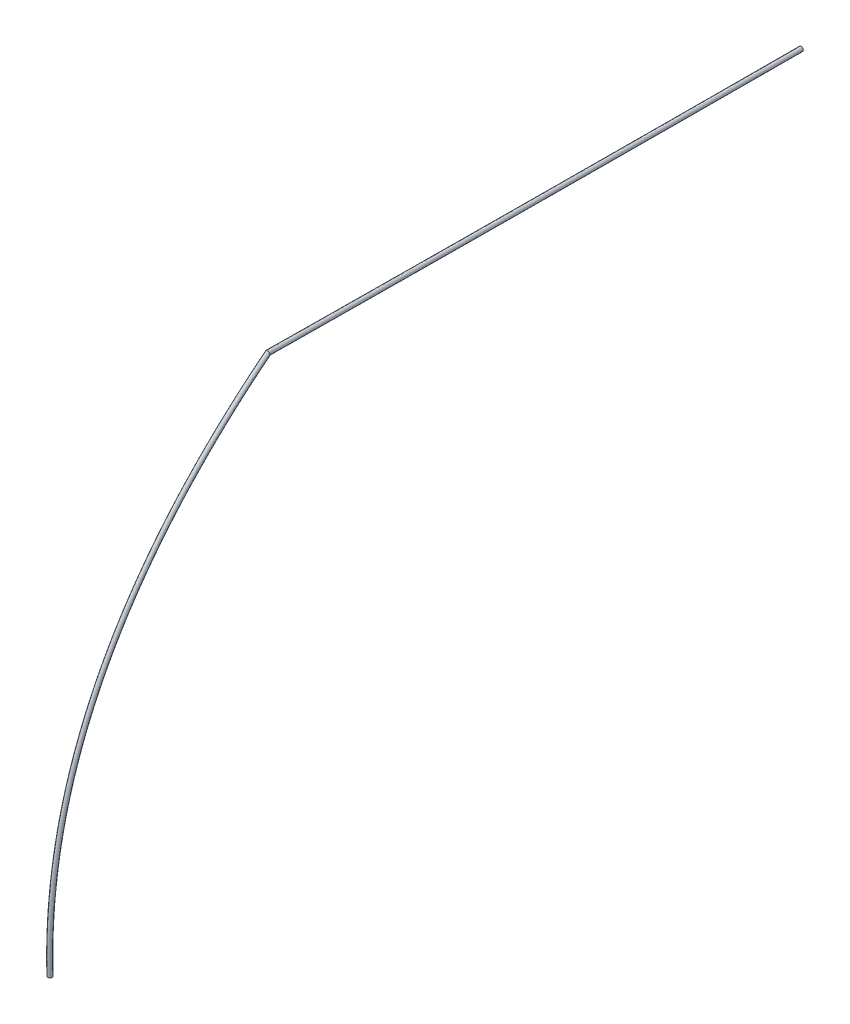
ISO-10303-21;
HEADER;
FILE_DESCRIPTION(('STEP AP214'),'2;1');
FILE_NAME('part.step','',(''),(''),'','','');
FILE_SCHEMA(('AUTOMOTIVE_DESIGN { 1 0 10303 214 1 1 1 1 }'));
ENDSEC;
DATA;
#1=APPLICATION_CONTEXT('core data for automotive mechanical design processes');
#2=APPLICATION_PROTOCOL_DEFINITION('international standard','automotive_design',2000,#1);
#3=PRODUCT_CONTEXT('',#1,'mechanical');
#4=PRODUCT('Part','Part','',(#3));
#5=PRODUCT_RELATED_PRODUCT_CATEGORY('part','',(#4));
#6=PRODUCT_DEFINITION_FORMATION('','',#4);
#7=PRODUCT_DEFINITION_CONTEXT('part definition',#1,'design');
#8=PRODUCT_DEFINITION('design','',#6,#7);
#9=PRODUCT_DEFINITION_SHAPE('','',#8);
#10=(LENGTH_UNIT() NAMED_UNIT(*) SI_UNIT(.MILLI.,.METRE.));
#11=(NAMED_UNIT(*) PLANE_ANGLE_UNIT() SI_UNIT($,.RADIAN.));
#12=(NAMED_UNIT(*) SI_UNIT($,.STERADIAN.) SOLID_ANGLE_UNIT());
#13=UNCERTAINTY_MEASURE_WITH_UNIT(LENGTH_MEASURE(1.E-05),#10,'distance_accuracy_value','');
#14=(GEOMETRIC_REPRESENTATION_CONTEXT(3) GLOBAL_UNCERTAINTY_ASSIGNED_CONTEXT((#13)) GLOBAL_UNIT_ASSIGNED_CONTEXT((#10,
#11,#12)) REPRESENTATION_CONTEXT('',''));
#15=CARTESIAN_POINT('',(0.,0.,0.));
#16=DIRECTION('',(0.,0.,1.));
#17=DIRECTION('',(1.,0.,0.));
#18=AXIS2_PLACEMENT_3D('',#15,#16,#17);
#19=CARTESIAN_POINT('',(-252.18850722934,-2246.93364927449,7208.37977316009));
#20=DIRECTION('',(0.00187095814067323,-0.999442047397408,-0.0333480645572148));
#21=DIRECTION('',(0.996001194043314,-0.00111622715859024,0.0893329474562594));
#22=AXIS2_PLACEMENT_3D('',#19,#20,#21);
#23=PLANE('',#22);
#24=CARTESIAN_POINT('',(-252.18850722934,-2246.93364927449,7208.37977316009));
#25=DIRECTION('',(0.00187095814067323,-0.999442047397408,-0.0333480645572148));
#26=DIRECTION('',(0.996001194043314,-0.00111622715859024,0.0893329474562594));
#27=AXIS2_PLACEMENT_3D('',#24,#25,#26);
#28=CIRCLE('',#27,19.05);
#29=CARTESIAN_POINT('',(-233.214684482815,-2246.95491340187,7210.08156580914));
#30=VERTEX_POINT('',#29);
#31=EDGE_CURVE('E46',#30,#30,#28,.T.);
#32=ORIENTED_EDGE('',*,*,#31,.T.);
#33=EDGE_LOOP('',(#32));
#34=FACE_BOUND('',#33,.T.);
#35=ADVANCED_FACE('F43',(#34),#23,.T.);
#36=CARTESIAN_POINT('',(20.8652226595486,1756.45567892885,927.868940997193));
#37=DIRECTION('',(0.,0.,1.));
#38=DIRECTION('',(1.,0.,0.));
#39=AXIS2_PLACEMENT_3D('',#36,#37,#38);
#40=PLANE('',#39);
#41=CARTESIAN_POINT('',(20.8652226595486,1756.45567892885,927.868940997193));
#42=DIRECTION('',(0.,0.,1.));
#43=DIRECTION('',(1.,0.,0.));
#44=AXIS2_PLACEMENT_3D('',#41,#42,#43);
#45=CIRCLE('',#44,19.05);
#46=CARTESIAN_POINT('',(39.9152226595486,1756.45567892885,927.868940997193));
#47=VERTEX_POINT('',#46);
#48=EDGE_CURVE('E65',#47,#47,#45,.T.);
#49=ORIENTED_EDGE('',*,*,#48,.F.);
#50=EDGE_LOOP('',(#49));
#51=FACE_BOUND('',#50,.T.);
#52=ADVANCED_FACE('F96',(#51),#40,.F.);
#53=CARTESIAN_POINT('',(19.9930689835937,1777.36160258511,5545.85894253114));
#54=CARTESIAN_POINT('',(19.3355368097014,1772.66039736171,5550.28089226517));
#55=CARTESIAN_POINT('',(18.6779618821094,1767.95889001023,5554.7031295848));
#56=CARTESIAN_POINT('',(17.3550982955482,1758.50070963912,5563.59947936861));
#57=CARTESIAN_POINT('',(16.6911317688225,1753.74222914693,5568.06450398315));
#58=CARTESIAN_POINT('',(15.3657547904619,1744.22102663837,5576.9769706444));
#59=CARTESIAN_POINT('',(14.7043875405338,1739.45861048081,5581.42412212676));
#60=CARTESIAN_POINT('',(12.7242495028948,1725.16591731002,5594.73833107276));
#61=CARTESIAN_POINT('',(11.4094424285931,1715.63019559349,5603.57814296001));
#62=CARTESIAN_POINT('',(7.48087602867862,1687.00125176661,5629.98859663978));
#63=CARTESIAN_POINT('',(4.88297152858878,1667.88625098898,5647.45025651571));
#64=CARTESIAN_POINT('',(-2.84732290263034,1610.45413495788,5699.39930988561));
#65=CARTESIAN_POINT('',(-7.91629375987648,1572.04990598364,5733.4507770182));
#66=CARTESIAN_POINT('',(-22.8695319936948,1456.48877165584,5833.86148683239));
#67=CARTESIAN_POINT('',(-32.5001249693716,1378.98341912199,5898.47703743689));
#68=CARTESIAN_POINT('',(-60.3772239575552,1145.07361951336,6085.34904262698));
#69=CARTESIAN_POINT('',(-77.6090492721612,987.275439330475,6200.63084577142));
#70=CARTESIAN_POINT('',(-125.245974180515,508.306083821919,6518.57882723388));
#71=CARTESIAN_POINT('',(-151.592523215257,181.560299240317,6693.34758512464));
#72=CARTESIAN_POINT('',(-193.463898099958,-486.800387815492,6968.49930287592));
#73=CARTESIAN_POINT('',(-208.988750468306,-828.415357870622,7068.88244404288));
#74=CARTESIAN_POINT('',(-229.217488003033,-1526.52359716673,7195.26794739456));
#75=CARTESIAN_POINT('',(-233.921378028054,-1883.01709422352,7221.27034041267));
#76=CARTESIAN_POINT('',(-233.214684482815,-2246.95491340187,7210.08156580914));
#77=CARTESIAN_POINT('',(18.1584876422309,1803.4986348941,5573.51938094741));
#78=CARTESIAN_POINT('',(17.5009554683385,1798.7974296707,5577.94133068145));
#79=CARTESIAN_POINT('',(16.8449050889727,1794.1068785701,5582.35331628602));
#80=CARTESIAN_POINT('',(15.5189741232593,1784.62665430759,5591.27029244064));
#81=CARTESIAN_POINT('',(14.8503781892923,1779.8348518224,5595.76644625644));
#82=CARTESIAN_POINT('',(13.5188263098361,1770.26906206078,5604.720431915));
#83=CARTESIAN_POINT('',(12.8543707351721,1765.48429300619,5609.18834785364));
#84=CARTESIAN_POINT('',(10.8649652223897,1751.12436276139,5622.56486417304));
#85=CARTESIAN_POINT('',(9.54397649707592,1741.54357848287,5631.44623300628));
#86=CARTESIAN_POINT('',(5.59685613419261,1712.77872892997,5657.98140671279));
#87=CARTESIAN_POINT('',(2.98657030580701,1693.57216691362,5675.52627890123));
#88=CARTESIAN_POINT('',(-4.78089593565253,1635.86246005635,5727.7251090913));
#89=CARTESIAN_POINT('',(-9.87468522402128,1597.26929374572,5761.94328148546));
#90=CARTESIAN_POINT('',(-24.9024200392103,1481.12945895814,5862.85418243224));
#91=CARTESIAN_POINT('',(-34.5827344442719,1403.22244191747,5927.80330785993));
#92=CARTESIAN_POINT('',(-62.6085336806022,1168.05839768658,6115.67199975976));
#93=CARTESIAN_POINT('',(-79.9389011216102,1009.3580789138,6231.61305918607));
#94=CARTESIAN_POINT('',(-127.863517684465,527.480151406309,6551.48093204932));
#95=CARTESIAN_POINT('',(-154.391258773977,198.518394171012,6727.4521632449));
#96=CARTESIAN_POINT('',(-196.565137569496,-474.705204311014,7004.59114422868));
#97=CARTESIAN_POINT('',(-212.210352300016,-818.964620023371,7105.75261479604));
#98=CARTESIAN_POINT('',(-232.593120189293,-1522.46092016144,7233.09920984275));
#99=CARTESIAN_POINT('',(-237.330509573372,-1881.68982754755,7259.28335274389));
#100=CARTESIAN_POINT('',(-236.617788976608,-2248.22676189918,7248.00795874604));
#101=CARTESIAN_POINT('',(-19.700202222522,1805.06006788384,5569.53296291326));
#102=CARTESIAN_POINT('',(-20.3577343964144,1800.35886266043,5573.95491264874));
#103=CARTESIAN_POINT('',(-21.0136993319229,1795.66891592593,5578.36632352495));
#104=CARTESIAN_POINT('',(-22.3398022100114,1786.18747568354,5587.28445602565));
#105=CARTESIAN_POINT('',(-23.0086576039116,1781.39383507232,5591.78235502627));
#106=CARTESIAN_POINT('',(-24.3405555715037,1771.82558570624,5600.73866841085));
#107=CARTESIAN_POINT('',(-25.0051842426302,1767.0395835552,5605.20774851437));
#108=CARTESIAN_POINT('',(-26.9951091951415,1752.67594411753,5618.58775818197));
#109=CARTESIAN_POINT('',(-28.3164444145411,1743.09267382931,5627.47145706338));
#110=CARTESIAN_POINT('',(-32.2646048071133,1714.32032635545,5654.01362395864));
#111=CARTESIAN_POINT('',(-34.8755847190111,1695.10871254013,5671.56316234445));
#112=CARTESIAN_POINT('',(-42.6451349435276,1637.3836887386,5723.77600021644));
#113=CARTESIAN_POINT('',(-47.7403158767096,1598.78009572763,5758.0035231454));
#114=CARTESIAN_POINT('',(-62.7722286881957,1482.60832001809,5858.9424854431));
#115=CARTESIAN_POINT('',(-72.4553326250294,1404.67912724489,5923.91033166766));
#116=CARTESIAN_POINT('',(-100.489477859943,1169.44581631448,6111.83498361922));
#117=CARTESIAN_POINT('',(-117.825380710693,1010.69565000493,6227.81308974723));
#118=CARTESIAN_POINT('',(-165.76617564052,528.656916515392,6547.78897651673));
#119=CARTESIAN_POINT('',(-192.304130990329,199.572526842321,6723.82803400319));
#120=CARTESIAN_POINT('',(-234.495138235376,-473.920481967876,7001.07964138869));
#121=CARTESIAN_POINT('',(-250.147214201317,-818.326539881205,7102.28555231956));
#122=CARTESIAN_POINT('',(-270.538892589564,-1522.12190745459,7229.68796576759));
#123=CARTESIAN_POINT('',(-275.27832140534,-1881.50278429179,7255.88342787237));
#124=CARTESIAN_POINT('',(-274.565434469658,-2248.18423364444,7244.60437344795));
#125=CARTESIAN_POINT('',(-17.8656208811592,1778.92303557484,5541.87252449698));
#126=CARTESIAN_POINT('',(-18.5231530550516,1774.22183035144,5546.29447423102));
#127=CARTESIAN_POINT('',(-19.1806425387862,1769.52092736606,5550.71613682229));
#128=CARTESIAN_POINT('',(-20.5036780377226,1760.06153101507,5559.61364295508));
#129=CARTESIAN_POINT('',(-21.1679040243813,1755.30121239686,5564.08041275298));
#130=CARTESIAN_POINT('',(-22.4936270908778,1745.77755028383,5572.99520714026));
#131=CARTESIAN_POINT('',(-23.1551674372231,1741.01390102981,5577.44352278749));
#132=CARTESIAN_POINT('',(-25.1358249147273,1726.71749866616,5590.76122508169));
#133=CARTESIAN_POINT('',(-26.4509784829334,1717.17929093849,5599.6033670113));
#134=CARTESIAN_POINT('',(-30.3805849128085,1688.54284919499,5626.02081389722));
#135=CARTESIAN_POINT('',(-32.9791834960493,1669.4227966126,5643.48713995893));
#136=CARTESIAN_POINT('',(-40.7115619108654,1611.97536364589,5695.45020101075));
#137=CARTESIAN_POINT('',(-45.7819244125648,1573.56070796555,5729.51101870092));
#138=CARTESIAN_POINT('',(-60.7393406426802,1457.9676327158,5829.94978979771));
#139=CARTESIAN_POINT('',(-70.3727231501291,1380.44010444941,5894.58406126687));
#140=CARTESIAN_POINT('',(-98.258168136896,1146.46103814125,6081.51202644192));
#141=CARTESIAN_POINT('',(-115.495528862579,988.613010421607,6196.83087646069));
#142=CARTESIAN_POINT('',(-163.148632133901,509.482848931002,6514.88687144506));
#143=CARTESIAN_POINT('',(-189.505395434121,182.614431911625,6689.72345572213));
#144=CARTESIAN_POINT('',(-231.393898763325,-486.015665472354,6964.98780019671));
#145=CARTESIAN_POINT('',(-246.925612364681,-827.777277728455,7065.41538164522));
#146=CARTESIAN_POINT('',(-267.16326040823,-1526.18458445988,7191.85670324058));
#147=CARTESIAN_POINT('',(-271.869189834752,-1882.83005084646,7217.87041521769));
#148=CARTESIAN_POINT('',(-271.162329975865,-2246.91238514712,7206.67798051105));
#149=CARTESIAN_POINT('',(-16.0310395397964,1752.78600326585,5514.21208608071));
#150=CARTESIAN_POINT('',(-16.6885717136888,1748.08479804244,5518.6340358133));
#151=CARTESIAN_POINT('',(-17.3475857456495,1743.37293880619,5523.06595011963));
#152=CARTESIAN_POINT('',(-18.6675538654338,1733.9355863466,5531.94282988451));
#153=CARTESIAN_POINT('',(-19.3271504448511,1729.20858972139,5536.37847047969));
#154=CARTESIAN_POINT('',(-20.646698610252,1719.72951486142,5545.25174586967));
#155=CARTESIAN_POINT('',(-21.305150631816,1714.98821850443,5549.67929706061));
#156=CARTESIAN_POINT('',(-23.276540634313,1700.75905321479,5562.93469198142));
#157=CARTESIAN_POINT('',(-24.5855125513257,1691.26590804767,5571.73527695923));
#158=CARTESIAN_POINT('',(-28.4965650185036,1662.76537203454,5598.02800383581));
#159=CARTESIAN_POINT('',(-31.0827822730875,1643.73688068508,5615.41111757341));
#160=CARTESIAN_POINT('',(-38.7779888782034,1586.56703855319,5667.12440180507));
#161=CARTESIAN_POINT('',(-43.8235329484201,1548.34132020348,5701.01851425645));
#162=CARTESIAN_POINT('',(-58.7064525971647,1433.32694541351,5800.95709415232));
#163=CARTESIAN_POINT('',(-68.2901136752289,1356.20108165393,5865.25779086609));
#164=CARTESIAN_POINT('',(-96.026858413849,1123.47625996802,6051.18906926462));
#165=CARTESIAN_POINT('',(-113.165677014464,966.530370838284,6165.84866317416));
#166=CARTESIAN_POINT('',(-160.531088627282,490.308781346612,6481.9847663734));
#167=CARTESIAN_POINT('',(-186.706659877914,165.656336980929,6655.61887744107));
#168=CARTESIAN_POINT('',(-228.292659291275,-498.110848976832,6928.89595900474));
#169=CARTESIAN_POINT('',(-243.704010528045,-837.228015575706,7028.54521097088));
#170=CARTESIAN_POINT('',(-263.787628226895,-1530.24726146518,7154.02544071358));
#171=CARTESIAN_POINT('',(-268.460058264163,-1884.15731740113,7179.85740256302));
#172=CARTESIAN_POINT('',(-267.759225482073,-2245.64053664981,7168.75158757415));
#173=CARTESIAN_POINT('',(21.8276503249565,1751.22457027612,5518.19850411486));
#174=CARTESIAN_POINT('',(21.1701181510641,1746.52336505271,5522.6204538489));
#175=CARTESIAN_POINT('',(20.5110186752461,1741.81090145036,5527.05294288358));
#176=CARTESIAN_POINT('',(19.1912224678369,1732.37476497065,5535.92866629659));
#177=CARTESIAN_POINT('',(18.5318853483528,1727.64960647147,5540.36256170986));
#178=CARTESIAN_POINT('',(17.2126832710878,1718.17299121596,5549.23350937382));
#179=CARTESIAN_POINT('',(16.5544043458955,1713.43292795542,5553.65989639987));
#180=CARTESIAN_POINT('',(14.5835337833999,1699.20747185865,5566.91179797249));
#181=CARTESIAN_POINT('',(13.2749083601102,1689.71681270412,5575.71005291373));
#182=CARTESIAN_POINT('',(9.36489592316458,1661.22377460326,5601.99578656677));
#183=CARTESIAN_POINT('',(6.77937275137053,1642.20033506434,5619.37423413019));
#184=CARTESIAN_POINT('',(-0.913749869608184,1585.04580985942,5671.07351067993));
#185=CARTESIAN_POINT('',(-5.95790229573169,1546.83051822156,5704.95827255095));
#186=CARTESIAN_POINT('',(-20.8366439481793,1431.84808435355,5804.86879123255));
#187=CARTESIAN_POINT('',(-30.4175154944713,1354.74439632651,5869.15076701385));
#188=CARTESIAN_POINT('',(-58.1459142345081,1122.08884134013,6055.0260854942));
#189=CARTESIAN_POINT('',(-75.2791974227122,965.192799747152,6169.64863235678));
#190=CARTESIAN_POINT('',(-122.628430676565,489.132016237528,6485.67672241844));
#191=CARTESIAN_POINT('',(-148.793787656537,164.602204309621,6659.24300700437));
#192=CARTESIAN_POINT('',(-190.36265863042,-498.89557131997,6932.40746152315));
#193=CARTESIAN_POINT('',(-205.767148636596,-837.866095717872,7032.01227328973));
#194=CARTESIAN_POINT('',(-225.841855816773,-1530.58627417203,7157.43668494637));
#195=CARTESIAN_POINT('',(-230.512246482736,-1884.34436089949,7183.25732808146));
#196=CARTESIAN_POINT('',(-229.811579989022,-2245.68306490455,7172.15517287224));
#197=CARTESIAN_POINT('',(19.9930689835937,1777.36160258511,5545.85894253114));
#198=CARTESIAN_POINT('',(19.3355368097014,1772.66039736171,5550.28089226517));
#199=CARTESIAN_POINT('',(18.6779618821094,1767.95889001023,5554.7031295848));
#200=CARTESIAN_POINT('',(17.3550982955482,1758.50070963912,5563.59947936861));
#201=CARTESIAN_POINT('',(16.6911317688225,1753.74222914693,5568.06450398315));
#202=CARTESIAN_POINT('',(15.3657547904619,1744.22102663837,5576.9769706444));
#203=CARTESIAN_POINT('',(14.7043875405338,1739.45861048081,5581.42412212676));
#204=CARTESIAN_POINT('',(12.7242495028948,1725.16591731002,5594.73833107276));
#205=CARTESIAN_POINT('',(11.4094424285931,1715.63019559349,5603.57814296001));
#206=CARTESIAN_POINT('',(7.48087602867862,1687.00125176661,5629.98859663978));
#207=CARTESIAN_POINT('',(4.88297152858878,1667.88625098898,5647.45025651571));
#208=CARTESIAN_POINT('',(-2.84732290263034,1610.45413495788,5699.39930988561));
#209=CARTESIAN_POINT('',(-7.91629375987648,1572.04990598364,5733.4507770182));
#210=CARTESIAN_POINT('',(-22.8695319936948,1456.48877165584,5833.86148683239));
#211=CARTESIAN_POINT('',(-32.5001249693716,1378.98341912199,5898.47703743689));
#212=CARTESIAN_POINT('',(-60.3772239575552,1145.07361951336,6085.34904262698));
#213=CARTESIAN_POINT('',(-77.6090492721612,987.275439330475,6200.63084577142));
#214=CARTESIAN_POINT('',(-125.245974180515,508.306083821919,6518.57882723388));
#215=CARTESIAN_POINT('',(-151.592523215257,181.560299240317,6693.34758512464));
#216=CARTESIAN_POINT('',(-193.463898099958,-486.800387815492,6968.49930287592));
#217=CARTESIAN_POINT('',(-208.988750468306,-828.415357870622,7068.88244404288));
#218=CARTESIAN_POINT('',(-229.217488003033,-1526.52359716673,7195.26794739456));
#219=CARTESIAN_POINT('',(-233.921378028054,-1883.01709422352,7221.27034041267));
#220=CARTESIAN_POINT('',(-233.214684482815,-2246.95491340187,7210.08156580914));
#221=(BOUNDED_SURFACE() B_SPLINE_SURFACE(3,3,((#53,#54,#55,#56,#57,#58,#59,#60,#61,#62,#63,#64,
#65,#66,#67,#68,#69,#70,#71,#72,#73,#74,#75,#76),(#77,#78,#79,#80,#81,#82,#83,#84,#85,#86,#87,
#88,#89,#90,#91,#92,#93,#94,#95,#96,#97,#98,#99,#100),(#101,#102,#103,#104,#105,#106,#107,#108,
#109,#110,#111,#112,#113,#114,#115,#116,#117,#118,#119,#120,#121,#122,#123,#124),(#125,#126,
#127,#128,#129,#130,#131,#132,#133,#134,#135,#136,#137,#138,#139,#140,#141,#142,#143,#144,#145,
#146,#147,#148),(#149,#150,#151,#152,#153,#154,#155,#156,#157,#158,#159,#160,#161,#162,#163,
#164,#165,#166,#167,#168,#169,#170,#171,#172),(#173,#174,#175,#176,#177,#178,#179,#180,#181,
#182,#183,#184,#185,#186,#187,#188,#189,#190,#191,#192,#193,#194,#195,#196),(#197,#198,#199,
#200,#201,#202,#203,#204,#205,#206,#207,#208,#209,#210,#211,#212,#213,#214,#215,#216,#217,#218,
#219,#220)),.UNSPECIFIED.,.T.,.F.,.F.) B_SPLINE_SURFACE_WITH_KNOTS((4,3,4),(4,2,2,2,2,2,2,2,2,2,
2,4),(0.,0.5,1.),(-0.0038599605490093,0.,0.00390625,0.0078125,0.015625,0.03125,0.0625,0.125,
0.25,0.5,0.75,1.),.UNSPECIFIED.) GEOMETRIC_REPRESENTATION_ITEM() RATIONAL_B_SPLINE_SURFACE(((1.,
1.,1.,1.,1.,1.,1.,1.,1.,1.,1.,1.,1.,1.,1.,1.,1.,1.,1.,1.,1.,1.,1.,1.),(0.333333333333333,
0.333333333333333,0.333333333333333,0.333333333333333,0.333333333333333,0.333333333333333,
0.333333333333333,0.333333333333333,0.333333333333333,0.333333333333333,0.333333333333333,
0.333333333333333,0.333333333333333,0.333333333333333,0.333333333333333,0.333333333333333,
0.333333333333333,0.333333333333333,0.333333333333333,0.333333333333333,0.333333333333333,
0.333333333333333,0.333333333333333,0.333333333333333),(0.333333333333333,0.333333333333333,
0.333333333333333,0.333333333333333,0.333333333333333,0.333333333333333,0.333333333333333,
0.333333333333333,0.333333333333333,0.333333333333333,0.333333333333333,0.333333333333333,
0.333333333333333,0.333333333333333,0.333333333333333,0.333333333333333,0.333333333333333,
0.333333333333333,0.333333333333333,0.333333333333333,0.333333333333333,0.333333333333333,
0.333333333333333,0.333333333333333),(1.,1.,1.,1.,1.,1.,1.,1.,1.,1.,1.,1.,1.,1.,1.,1.,1.,1.,1.,
1.,1.,1.,1.,1.),(0.333333333333333,0.333333333333333,0.333333333333333,0.333333333333333,
0.333333333333333,0.333333333333333,0.333333333333333,0.333333333333333,0.333333333333333,
0.333333333333333,0.333333333333333,0.333333333333333,0.333333333333333,0.333333333333333,
0.333333333333333,0.333333333333333,0.333333333333333,0.333333333333333,0.333333333333333,
0.333333333333333,0.333333333333333,0.333333333333333,0.333333333333333,0.333333333333333),
(0.333333333333333,0.333333333333333,0.333333333333333,0.333333333333333,0.333333333333333,
0.333333333333333,0.333333333333333,0.333333333333333,0.333333333333333,0.333333333333333,
0.333333333333333,0.333333333333333,0.333333333333333,0.333333333333333,0.333333333333333,
0.333333333333333,0.333333333333333,0.333333333333333,0.333333333333333,0.333333333333333,
0.333333333333333,0.333333333333333,0.333333333333333,0.333333333333333),(1.,1.,1.,1.,1.,1.,1.,
1.,1.,1.,1.,1.,1.,1.,1.,1.,1.,1.,1.,1.,1.,1.,1.,1.))) REPRESENTATION_ITEM('') SURFACE());
#222=CARTESIAN_POINT('',(17.9797070556018,1761.57094989232,5557.31666536347));
#223=CARTESIAN_POINT('',(17.9809437308594,1761.58073773358,5557.32096119298));
#224=CARTESIAN_POINT('',(17.982172807388,1761.59052665233,5557.3252569828));
#225=CARTESIAN_POINT('',(18.0542698090882,1762.16837527862,5557.57881104861));
#226=CARTESIAN_POINT('',(18.0995573157962,1762.74002202747,5557.82791855133));
#227=CARTESIAN_POINT('',(18.1384685982519,1763.88630570849,5558.32401189403));
#228=CARTESIAN_POINT('',(18.1320554176419,1764.46094448613,5558.57099608998));
#229=CARTESIAN_POINT('',(18.0671543104554,1765.61056735746,5559.06167302012));
#230=CARTESIAN_POINT('',(18.0085271523412,1766.18554826415,5559.30535518432));
#231=CARTESIAN_POINT('',(17.8389249827471,1767.33007063158,5559.78692042121));
#232=CARTESIAN_POINT('',(17.7279597223038,1767.89961308539,5560.02480456545));
#233=CARTESIAN_POINT('',(17.4536508369517,1769.02978087005,5560.49327413889));
#234=CARTESIAN_POINT('',(17.2902514777669,1769.59039604318,5560.72385151361));
#235=CARTESIAN_POINT('',(16.9114538085645,1770.69775026782,5561.17559758541));
#236=CARTESIAN_POINT('',(16.6960525018669,1771.24448851764,5561.39676573943));
#237=CARTESIAN_POINT('',(16.2141094705661,1772.31910094936,5561.82760249975));
#238=CARTESIAN_POINT('',(15.9476080541254,1772.84698961319,5562.03728000345));
#239=CARTESIAN_POINT('',(15.3644035673766,1773.87964293624,5562.44336336476));
#240=CARTESIAN_POINT('',(15.0477038508902,1774.38440913741,5562.63977010775));
#241=CARTESIAN_POINT('',(14.3816431471884,1775.34292021303,5563.00845941596));
#242=CARTESIAN_POINT('',(14.0345161978954,1775.79794802511,5563.18144189775));
#243=CARTESIAN_POINT('',(13.2977900443249,1776.6783592637,5563.51183840358));
#244=CARTESIAN_POINT('',(12.9081914417664,1777.10374311004,5563.66925264811));
#245=CARTESIAN_POINT('',(12.0889510488683,1777.92041546237,5563.96675678295));
#246=CARTESIAN_POINT('',(11.6593223596333,1778.31171504296,5564.10685230666));
#247=CARTESIAN_POINT('',(10.7628097736343,1779.05609327909,5564.36812689868));
#248=CARTESIAN_POINT('',(10.2959292683766,1779.40917540718,5564.48930768607));
#249=CARTESIAN_POINT('',(9.36992043790923,1780.04457197874,5564.70171265591));
#250=CARTESIAN_POINT('',(8.91355526036562,1780.33035779319,5564.7946139189));
#251=CARTESIAN_POINT('',(7.97579915257747,1780.86364339581,5564.96227970852));
#252=CARTESIAN_POINT('',(7.49440964459859,1781.11114535669,5565.03704526454));
#253=CARTESIAN_POINT('',(6.51043548230834,1781.56513027991,5565.16751598564));
#254=CARTESIAN_POINT('',(6.00786044526899,1781.77163161667,5565.22322969692));
#255=CARTESIAN_POINT('',(4.98533871985234,1782.14150132966,5565.31493911496));
#256=CARTESIAN_POINT('',(4.46539297295522,1782.30487203928,5565.35093588853));
#257=CARTESIAN_POINT('',(3.45135594981951,1782.57631577613,5565.40082899645));
#258=CARTESIAN_POINT('',(2.95818602626782,1782.68757848684,5565.41615948335));
#259=CARTESIAN_POINT('',(1.96435413941668,1782.87059821582,5565.42931668743));
#260=CARTESIAN_POINT('',(1.46369261071164,1782.94235751667,5565.42714441608));
#261=CARTESIAN_POINT('',(0.45871900958547,1783.0458031862,5565.40530560675));
#262=CARTESIAN_POINT('',(-0.0455924115609672,1783.07749653505,5565.38564211707));
#263=CARTESIAN_POINT('',(-1.0541671249215,1783.10071754711,5565.32902522678));
#264=CARTESIAN_POINT('',(-1.55843041720056,1783.09224526533,5565.29207184985));
#265=CARTESIAN_POINT('',(-2.55000522886983,1783.03620421976,5565.20245197769));
#266=CARTESIAN_POINT('',(-3.03741499355464,1782.98966453205,5565.15022205598));
#267=CARTESIAN_POINT('',(-4.00529879619644,1782.85948384669,5565.03024655865));
#268=CARTESIAN_POINT('',(-4.48577301826969,1782.77584383582,5564.96250139573));
#269=CARTESIAN_POINT('',(-5.43664242020875,1782.5724757578,5564.81213927274));
#270=CARTESIAN_POINT('',(-5.90703747301174,1782.45274723597,5564.7295221253));
#271=CARTESIAN_POINT('',(-6.83481271844348,1782.1785084873,5564.55017237595));
#272=CARTESIAN_POINT('',(-7.29219251550303,1782.02399720457,5564.45343934555));
#273=CARTESIAN_POINT('',(-8.20423348031319,1781.67679332974,5564.24371409808));
#274=CARTESIAN_POINT('',(-8.65843406224628,1781.48312633788,5564.13033277952));
#275=CARTESIAN_POINT('',(-9.54754309353388,1781.06251434252,5563.89051668577));
#276=CARTESIAN_POINT('',(-9.98245151697109,1780.8355692943,5563.76408189303));
#277=CARTESIAN_POINT('',(-10.8307471778164,1780.35039354236,5563.49916386818));
#278=CARTESIAN_POINT('',(-11.2441289336242,1780.09215492512,5563.360677591));
#279=CARTESIAN_POINT('',(-12.0472220235068,1779.54659186208,5563.07274566914));
#280=CARTESIAN_POINT('',(-12.4369309674853,1779.25926448715,5562.9232989212));
#281=CARTESIAN_POINT('',(-13.2508169210055,1778.60992560019,5562.58997401755));
#282=CARTESIAN_POINT('',(-13.6706291804729,1778.24330191837,5562.40439839866));
#283=CARTESIAN_POINT('',(-14.473685346919,1777.47747884549,5562.02163711956));
#284=CARTESIAN_POINT('',(-14.8569244426739,1777.07827518129,5561.82444993735));
#285=CARTESIAN_POINT('',(-15.5851593719152,1776.25047452378,5561.41994631588));
#286=CARTESIAN_POINT('',(-15.9301213415727,1775.82185203765,5561.21262113747));
#287=CARTESIAN_POINT('',(-16.5797697240894,1774.9390435065,5560.78962464799));
#288=CARTESIAN_POINT('',(-16.8844585444928,1774.4848589919,5560.57395383684));
#289=CARTESIAN_POINT('',(-17.4525540561763,1773.55385265882,5560.1355924613));
#290=CARTESIAN_POINT('',(-17.7159159459275,1773.07700699336,5559.91289458879));
#291=CARTESIAN_POINT('',(-18.1998982169097,1772.10442926948,5559.46219043422));
#292=CARTESIAN_POINT('',(-18.420517529449,1771.60869673919,5559.23418401958));
#293=CARTESIAN_POINT('',(-18.7184889649682,1770.85401391398,5558.88957905129));
#294=CARTESIAN_POINT('',(-18.812261364803,1770.60080130091,5558.77436627725));
#295=CARTESIAN_POINT('',(-18.9888174640381,1770.09098362321,5558.54320592851));
#296=CARTESIAN_POINT('',(-19.0716034997024,1769.83437929265,5558.42725851555));
#297=CARTESIAN_POINT('',(-19.303314850825,1769.0601782924,5558.0786265558));
#298=CARTESIAN_POINT('',(-19.43570908503,1768.53790026282,5557.84501834729));
#299=CARTESIAN_POINT('',(-19.5966958177628,1767.76703549363,5557.50249417392));
#300=CARTESIAN_POINT('',(-19.6428863073003,1767.52182417085,5557.39386909972));
#301=CARTESIAN_POINT('',(-19.7255748276586,1767.02988518234,5557.17660624403));
#302=CARTESIAN_POINT('',(-19.7620775591196,1766.78315831166,5557.06796849437));
#303=CARTESIAN_POINT('',(-19.7949711215283,1766.52603111039,5556.95509144819));
#304=CARTESIAN_POINT('',(-19.7962153623593,1766.5162445079,5556.95079570889));
#305=CARTESIAN_POINT('',(-19.7974519926411,1766.50645695581,5556.94650006359));
#306=B_SPLINE_CURVE_WITH_KNOTS('',3,(#222,#223,#224,#225,#226,#227,#228,#229,#230,#231,#232,
#233,#234,#235,#236,#237,#238,#239,#240,#241,#242,#243,#244,#245,#246,#247,#248,#249,#250,#251,
#252,#253,#254,#255,#256,#257,#258,#259,#260,#261,#262,#263,#264,#265,#266,#267,#268,#269,#270,
#271,#272,#273,#274,#275,#276,#277,#278,#279,#280,#281,#282,#283,#284,#285,#286,#287,#288,#289,
#290,#291,#292,#293,#294,#295,#296,#297,#298,#299,#300,#301,#302,#303,#304,#305),.UNSPECIFIED.,
.F.,.F.,(4,2,2,2,2,2,2,2,2,2,2,2,2,2,2,2,2,2,2,2,2,2,2,2,2,2,2,2,2,2,2,2,2,2,2,2,2,2,2,2,2,4),
(0.,0.0322813490159536,1.90538945661197,3.77983660612799,5.65929709070743,7.53840755393611,
9.41952205116764,11.3007449759653,13.1804900371953,15.0601095628143,16.8514059836269,
18.6426770294708,20.4333638711143,22.2238878693957,23.8610008735415,25.498020933371,
27.1343056984985,28.7705019215661,30.2860253748224,31.8014612495119,33.3166330730376,
34.8318028213627,36.3073160275383,37.7827899912995,39.2582825446611,40.7338198944808,
42.2520007418569,43.7701836287123,45.2887512374718,46.8074719125681,48.5675492902689,
50.3278578890598,52.0897116231866,53.851459985341,55.6151052152339,57.3787945358185,
58.2593084466298,59.1396348140084,60.8992624318261,61.7155725211878,62.5314857979484,
62.5637659931925),.UNSPECIFIED.);
#307=CARTESIAN_POINT('',(-19.7974519926411,1766.50645695581,5556.94650006359));
#308=VERTEX_POINT('',#307);
#309=CARTESIAN_POINT('',(17.9797070556018,1761.57094989232,5557.31666536347));
#310=VERTEX_POINT('',#309);
#311=EDGE_CURVE('E11',#308,#310,#306,.F.);
#312=CARTESIAN_POINT('',(17.9797070556018,1761.57094989232,5557.31666536347));
#313=CARTESIAN_POINT('',(17.9784704229203,1761.56116224484,5557.3123690802));
#314=CARTESIAN_POINT('',(17.977226171056,1761.55137551044,5557.30807268213));
#315=CARTESIAN_POINT('',(17.9033234849163,1760.97368134993,5557.05443322822));
#316=CARTESIAN_POINT('',(17.8050174811106,1760.4088875245,5556.80472100875));
#317=CARTESIAN_POINT('',(17.5576662962597,1759.28969913368,5556.30639381538));
#318=CARTESIAN_POINT('',(17.4085848833471,1758.73531229329,5556.05777975377));
#319=CARTESIAN_POINT('',(17.0599452278213,1757.63960295899,5555.5628154627));
#320=CARTESIAN_POINT('',(16.8602530035348,1757.09831938658,5555.31647306962));
#321=CARTESIAN_POINT('',(16.4115675957929,1756.03448287142,5554.82857273006));
#322=CARTESIAN_POINT('',(16.1625836026818,1755.51192645845,5554.5870139009));
#323=CARTESIAN_POINT('',(15.6161520275419,1754.48891757016,5554.11019207353));
#324=CARTESIAN_POINT('',(15.3186532566536,1753.98848915924,5553.87493603412));
#325=CARTESIAN_POINT('',(14.6767915404803,1753.01443245986,5553.41285205747));
#326=CARTESIAN_POINT('',(14.3324258943989,1752.54080571813,5553.18602460691));
#327=CARTESIAN_POINT('',(13.5989005044763,1751.62495599776,5552.74292199165));
#328=CARTESIAN_POINT('',(13.2097761561952,1751.1827086455,5552.5266386787));
#329=CARTESIAN_POINT('',(12.3886994130524,1750.33349696054,5552.10643004487));
#330=CARTESIAN_POINT('',(11.9567498791145,1749.92653027432,5551.90250389994));
#331=CARTESIAN_POINT('',(11.0739073283462,1749.17034305464,5551.51827306416));
#332=CARTESIAN_POINT('',(10.6248552999941,1748.81930859936,5551.33730890274));
#333=CARTESIAN_POINT('',(9.69301661875601,1748.15684856687,5550.99021318225));
#334=CARTESIAN_POINT('',(9.21023044102366,1747.84542243193,5550.82408141435));
#335=CARTESIAN_POINT('',(8.21437988900222,1747.26586322476,5550.50847059433));
#336=CARTESIAN_POINT('',(7.70132545685507,1746.99771604371,5550.3589861202));
#337=CARTESIAN_POINT('',(6.64866160042991,1746.50799225047,5550.07833223564));
#338=CARTESIAN_POINT('',(6.10905460260193,1746.28641139263,5549.94716115589));
#339=CARTESIAN_POINT('',(5.05501276057758,1745.90976928093,5549.71515464654));
#340=CARTESIAN_POINT('',(4.54239202262179,1745.75063121632,5549.61268188019));
#341=CARTESIAN_POINT('',(3.50245352958518,1745.47583369924,5549.42550778482));
#342=CARTESIAN_POINT('',(2.97513661186458,1745.36017177499,5549.3408054456));
#343=CARTESIAN_POINT('',(1.91019375980426,1745.17398752924,5549.19017982938));
#344=CARTESIAN_POINT('',(1.37257258130788,1745.10344487657,5549.1242481016));
#345=CARTESIAN_POINT('',(0.29124738758591,1745.00856222081,5549.01190234178));
#346=CARTESIAN_POINT('',(-0.25245629561353,1744.98421970805,5548.96548724967));
#347=CARTESIAN_POINT('',(-1.30098711000435,1744.9823906077,5548.8954271902));
#348=CARTESIAN_POINT('',(-1.80571584123522,1745.0015721214,5548.87035218951));
#349=CARTESIAN_POINT('',(-2.81259663842061,1745.08007040737,5548.83767650399));
#350=CARTESIAN_POINT('',(-3.31474885193392,1745.13938485475,5548.83007480705));
#351=CARTESIAN_POINT('',(-4.31261591906384,1745.29770910127,5548.83241060963));
#352=CARTESIAN_POINT('',(-4.80833191954141,1745.39671172535,5548.84234493998));
#353=CARTESIAN_POINT('',(-5.78972884160924,1745.63355041724,5548.87961792351));
#354=CARTESIAN_POINT('',(-6.27540977823791,1745.77138642684,5548.9069565506));
#355=CARTESIAN_POINT('',(-7.2206221601522,1746.08050155771,5548.97777746479));
#356=CARTESIAN_POINT('',(-7.68050535464736,1746.25080846279,5549.02081742073));
#357=CARTESIAN_POINT('',(-8.58433975627124,1746.62551554754,5549.12264480547));
#358=CARTESIAN_POINT('',(-9.0282913777205,1746.82991483981,5549.18143182442));
#359=CARTESIAN_POINT('',(-9.897495865693,1747.2710286187,5549.31416775416));
#360=CARTESIAN_POINT('',(-10.3227476165228,1747.50774503002,5549.38811756812));
#361=CARTESIAN_POINT('',(-11.1520158092772,1748.01146670803,5549.55047111533));
#362=CARTESIAN_POINT('',(-11.5560316572199,1748.27847282129,5549.6388752526));
#363=CARTESIAN_POINT('',(-12.3520390832748,1748.84877584865,5549.83211384187));
#364=CARTESIAN_POINT('',(-12.7433372627174,1749.15290351952,5549.93735198852));
#365=CARTESIAN_POINT('',(-13.4989971331929,1749.78839683081,5550.16133877117));
#366=CARTESIAN_POINT('',(-13.8633584967261,1750.1197628023,5550.28008757138));
#367=CARTESIAN_POINT('',(-14.563398500995,1750.80714797785,5550.53009456129));
#368=CARTESIAN_POINT('',(-14.89907643581,1751.16316778826,5550.66135305871));
#369=CARTESIAN_POINT('',(-15.5403124755099,1751.8972522711,5550.93534787764));
#370=CARTESIAN_POINT('',(-15.8458681257768,1752.27531873609,5551.07808513282));
#371=CARTESIAN_POINT('',(-16.4455798358397,1753.07750466618,5551.38414401846));
#372=CARTESIAN_POINT('',(-16.7375134564625,1753.50300392849,5551.54820606775));
#373=CARTESIAN_POINT('',(-17.2845066703856,1754.37303509235,5551.8869493918));
#374=CARTESIAN_POINT('',(-17.5395648536368,1754.81756772086,5552.06163107228));
#375=CARTESIAN_POINT('',(-18.0121835948671,1755.72299922578,5552.42050370807));
#376=CARTESIAN_POINT('',(-18.2297104360435,1756.18391237426,5552.60470302265));
#377=CARTESIAN_POINT('',(-18.626404600902,1757.11875955853,5552.98122457899));
#378=CARTESIAN_POINT('',(-18.8055684663568,1757.59269476385,5553.17354755118));
#379=CARTESIAN_POINT('',(-19.1497000866713,1758.62436278267,5553.5952055235));
#380=CARTESIAN_POINT('',(-19.3082511872124,1759.18377722383,5553.82568519163));
#381=CARTESIAN_POINT('',(-19.573339519369,1760.31154231274,5554.29389913317));
#382=CARTESIAN_POINT('',(-19.6798942507407,1760.8798898874,5554.53163093717));
#383=CARTESIAN_POINT('',(-19.8408783833972,1762.02077134967,5555.01230964843));
#384=CARTESIAN_POINT('',(-19.8953787920113,1762.59329845794,5555.25524898793));
#385=CARTESIAN_POINT('',(-19.9525787550826,1763.73905257218,5555.74481900369));
#386=CARTESIAN_POINT('',(-19.9553083736201,1764.31227897862,5555.99144745435));
#387=CARTESIAN_POINT('',(-19.921606653351,1765.1504036101,5556.35451490037));
#388=CARTESIAN_POINT('',(-19.9052971043338,1765.41658895326,5556.47019080154));
#389=CARTESIAN_POINT('',(-19.8615466838783,1765.94779509755,5556.70176832636));
#390=CARTESIAN_POINT('',(-19.834112403858,1766.21281649448,5556.81766977598));
#391=CARTESIAN_POINT('',(-19.7999177232022,1766.48688042676,5556.93790973238));
#392=CARTESIAN_POINT('',(-19.7986886576996,1766.49666921022,5556.94220487082));
#393=CARTESIAN_POINT('',(-19.7974519926411,1766.50645695581,5556.94650006359));
#394=B_SPLINE_CURVE_WITH_KNOTS('',3,(#312,#313,#314,#315,#316,#317,#318,#319,#320,#321,#322,
#323,#324,#325,#326,#327,#328,#329,#330,#331,#332,#333,#334,#335,#336,#337,#338,#339,#340,#341,
#342,#343,#344,#345,#346,#347,#348,#349,#350,#351,#352,#353,#354,#355,#356,#357,#358,#359,#360,
#361,#362,#363,#364,#365,#366,#367,#368,#369,#370,#371,#372,#373,#374,#375,#376,#377,#378,#379,
#380,#381,#382,#383,#384,#385,#386,#387,#388,#389,#390,#391,#392,#393),.UNSPECIFIED.,.F.,.F.,(4,
2,2,2,2,2,2,2,2,2,2,2,2,2,2,2,2,2,2,2,2,2,2,2,2,2,2,2,2,2,2,2,2,2,2,2,2,2,2,2,4),(0.,
0.0322813489852182,1.9056927814549,3.78044383683653,5.66021071639693,7.5396274469845,
9.42104017080472,11.3025613606986,13.1826047269631,15.0625225820171,16.8541958444911,
18.6458438758987,20.4369066505059,22.2278060554921,23.8650068661326,25.5021145821519,
27.1384840809863,28.7747646868686,30.2900414886844,31.8052305187226,33.3201457476769,
34.8350587062378,36.3102291511002,37.7853612044633,39.2605811497926,40.7358423360444,
42.2540903766463,43.7723568731792,45.2906607246325,46.8090881982068,48.4317508152812,
50.0544754635937,51.6786504033559,53.3029716926581,55.1770027589762,57.0504026707571,
58.9212434114654,60.7909976933932,61.6629115903499,62.5343096302499,62.5665898255224),.UNSPECIFIED.);
#395=EDGE_CURVE('E52',#308,#310,#394,.F.);
#396=ORIENTED_EDGE('',*,*,#311,.F.);
#397=ORIENTED_EDGE('',*,*,#395,.T.);
#398=EDGE_LOOP('',(#396,#397));
#399=FACE_BOUND('',#398,.T.);
#400=ORIENTED_EDGE('',*,*,#31,.F.);
#401=EDGE_LOOP('',(#400));
#402=FACE_BOUND('',#401,.T.);
#403=ADVANCED_FACE('F59',(#399,#402),#221,.T.);
#404=CARTESIAN_POINT('',(39.9152226595486,1756.45567892885,927.868940997193));
#405=CARTESIAN_POINT('',(40.1494941604034,1758.46543087551,1699.45264340375));
#406=CARTESIAN_POINT('',(38.4520423177377,1760.10225081258,2471.03227972541));
#407=CARTESIAN_POINT('',(31.1936922071566,1762.6300261943,4014.18341694222));
#408=CARTESIAN_POINT('',(25.632634311456,1763.52099125831,4785.77081403332));
#409=CARTESIAN_POINT('',(18.0779226707928,1764.04330854678,5563.73263550132));
#410=CARTESIAN_POINT('',(18.0156756537083,1764.04761219667,5570.14265649519));
#411=CARTESIAN_POINT('',(17.9534273171046,1764.05191593067,5576.55280957632));
#412=CARTESIAN_POINT('',(39.9152226595486,1794.55567892885,927.868940997193));
#413=CARTESIAN_POINT('',(40.1493322514041,1796.56543087551,1699.46491964713));
#414=CARTESIAN_POINT('',(38.4516877641043,1798.20224483042,2471.05683199618));
#415=CARTESIAN_POINT('',(31.1928909064374,1800.72999657008,4014.23251977652));
#416=CARTESIAN_POINT('',(25.6314364951265,1801.6209319118,4785.83832793008));
#417=CARTESIAN_POINT('',(18.076581259994,1802.14323723754,5563.80633736298));
#418=CARTESIAN_POINT('',(18.0143354261058,1802.14754098601,5570.21630737324));
#419=CARTESIAN_POINT('',(17.952087089502,1802.15184472001,5576.6264604501));
#420=CARTESIAN_POINT('',(1.81522265954865,1794.55567892885,927.868940997193));
#421=CARTESIAN_POINT('',(2.04933225458289,1796.56526897855,1699.40132896511));
#422=CARTESIAN_POINT('',(0.351846972732515,1798.2019517898,2470.9296498664));
#423=CARTESIAN_POINT('',(-6.90631306950542,1800.72950257197,4013.97815776816));
#424=CARTESIAN_POINT('',(-12.4669714834666,1801.62034882464,4785.48858547674));
#425=CARTESIAN_POINT('',(-20.0215056854487,1802.14263445725,5563.42453793124));
#426=CARTESIAN_POINT('',(-20.0837541645949,1802.14693836798,5569.83477208178));
#427=CARTESIAN_POINT('',(-20.1460025012042,1802.15124210198,5576.24492516292));
#428=CARTESIAN_POINT('',(1.81522265954864,1756.45567892885,927.868940997193));
#429=CARTESIAN_POINT('',(2.04949416115635,1758.46526897855,1699.38905280739));
#430=CARTESIAN_POINT('',(0.352201524692914,1760.10195777196,2470.90509759564));
#431=CARTESIAN_POINT('',(-6.90551176711312,1762.62953219619,4013.92905493386));
#432=CARTESIAN_POINT('',(-12.4657736664679,1763.52040817116,4785.42107123734));
#433=CARTESIAN_POINT('',(-20.0201642746555,1764.04270576648,5563.35083607243));
#434=CARTESIAN_POINT('',(-20.0824139369979,1764.04700957864,5569.761121208));
#435=CARTESIAN_POINT('',(-20.1446622736017,1764.05131331265,5576.17127428913));
#436=CARTESIAN_POINT('',(1.81522265954864,1718.35567892885,927.868940997193));
#437=CARTESIAN_POINT('',(2.0496560677298,1720.36526897855,1699.37677664967));
#438=CARTESIAN_POINT('',(0.352556076653309,1722.00196375411,2470.88054532487));
#439=CARTESIAN_POINT('',(-6.90471046472083,1724.5295618204,4013.87995209957));
#440=CARTESIAN_POINT('',(-12.4645758494691,1725.42046751767,4785.35355699794));
#441=CARTESIAN_POINT('',(-20.0188228638623,1725.94277707571,5563.27713421362));
#442=CARTESIAN_POINT('',(-20.0810737094009,1725.94708078931,5569.68747033421));
#443=CARTESIAN_POINT('',(-20.1433220459991,1725.95138452331,5576.09762341535));
#444=CARTESIAN_POINT('',(39.9152226595486,1718.35567892885,927.868940997193));
#445=CARTESIAN_POINT('',(40.1496560694028,1720.36543087551,1699.44036716037));
#446=CARTESIAN_POINT('',(38.4523968713712,1722.00225679474,2471.00772745465));
#447=CARTESIAN_POINT('',(31.1944935078759,1724.53005581852,4014.13431410793));
#448=CARTESIAN_POINT('',(25.6338321277855,1725.42105060483,4785.70330013657));
#449=CARTESIAN_POINT('',(18.0792640815915,1725.94337985601,5563.65893363966));
#450=CARTESIAN_POINT('',(18.0170158813109,1725.94768340734,5570.06900561713));
#451=CARTESIAN_POINT('',(17.9547675447071,1725.95198714134,5576.47915870254));
#452=CARTESIAN_POINT('',(39.9152226595486,1756.45567892885,927.868940997193));
#453=CARTESIAN_POINT('',(40.1494941604034,1758.46543087551,1699.45264340375));
#454=CARTESIAN_POINT('',(38.4520423177377,1760.10225081258,2471.03227972541));
#455=CARTESIAN_POINT('',(31.1936922071566,1762.6300261943,4014.18341694222));
#456=CARTESIAN_POINT('',(25.632634311456,1763.52099125831,4785.77081403332));
#457=CARTESIAN_POINT('',(18.0779226707928,1764.04330854678,5563.73263550132));
#458=CARTESIAN_POINT('',(18.0156756537083,1764.04761219667,5570.14265649519));
#459=CARTESIAN_POINT('',(17.9534273171046,1764.05191593067,5576.55280957632));
#460=(BOUNDED_SURFACE() B_SPLINE_SURFACE(3,3,((#404,#405,#406,#407,#408,#409,#410,#411),(#412,
#413,#414,#415,#416,#417,#418,#419),(#420,#421,#422,#423,#424,#425,#426,#427),(#428,#429,#430,
#431,#432,#433,#434,#435),(#436,#437,#438,#439,#440,#441,#442,#443),(#444,#445,#446,#447,#448,
#449,#450,#451),(#452,#453,#454,#455,#456,#457,#458,#459)),.UNSPECIFIED.,.T.,.F.,
.F.) B_SPLINE_SURFACE_WITH_KNOTS((4,3,4),(4,2,2,4),(0.,0.5,1.),(0.,0.5,1.,1.00415415227829),
.UNSPECIFIED.) GEOMETRIC_REPRESENTATION_ITEM() RATIONAL_B_SPLINE_SURFACE(((1.,1.,1.,1.,1.,1.,1.,
1.),(0.333333333333333,0.333333333333333,0.333333333333333,0.333333333333333,0.333333333333333,
0.333333333333333,0.333333333333333,0.333333333333333),(0.333333333333333,0.333333333333333,
0.333333333333333,0.333333333333333,0.333333333333333,0.333333333333333,0.333333333333333,
0.333333333333333),(1.,1.,1.,1.,1.,1.,1.,1.),(0.333333333333333,0.333333333333333,
0.333333333333333,0.333333333333333,0.333333333333333,0.333333333333333,0.333333333333333,
0.333333333333333),(0.333333333333333,0.333333333333333,0.333333333333333,0.333333333333333,
0.333333333333333,0.333333333333333,0.333333333333333,0.333333333333333),(1.,1.,1.,1.,1.,1.,1.,1.))) REPRESENTATION_ITEM('') SURFACE());
#461=ORIENTED_EDGE('',*,*,#395,.F.);
#462=ORIENTED_EDGE('',*,*,#311,.T.);
#463=EDGE_LOOP('',(#461,#462));
#464=FACE_BOUND('',#463,.T.);
#465=ORIENTED_EDGE('',*,*,#48,.T.);
#466=EDGE_LOOP('',(#465));
#467=FACE_BOUND('',#466,.T.);
#468=ADVANCED_FACE('F62',(#464,#467),#460,.T.);
#469=CLOSED_SHELL('',(#35,#52,#403,#468));
#470=MANIFOLD_SOLID_BREP('B2',#469);
#471=ADVANCED_BREP_SHAPE_REPRESENTATION('',(#18,#470),#14);
#472=SHAPE_DEFINITION_REPRESENTATION(#9,#471);
ENDSEC;
END-ISO-10303-21;
